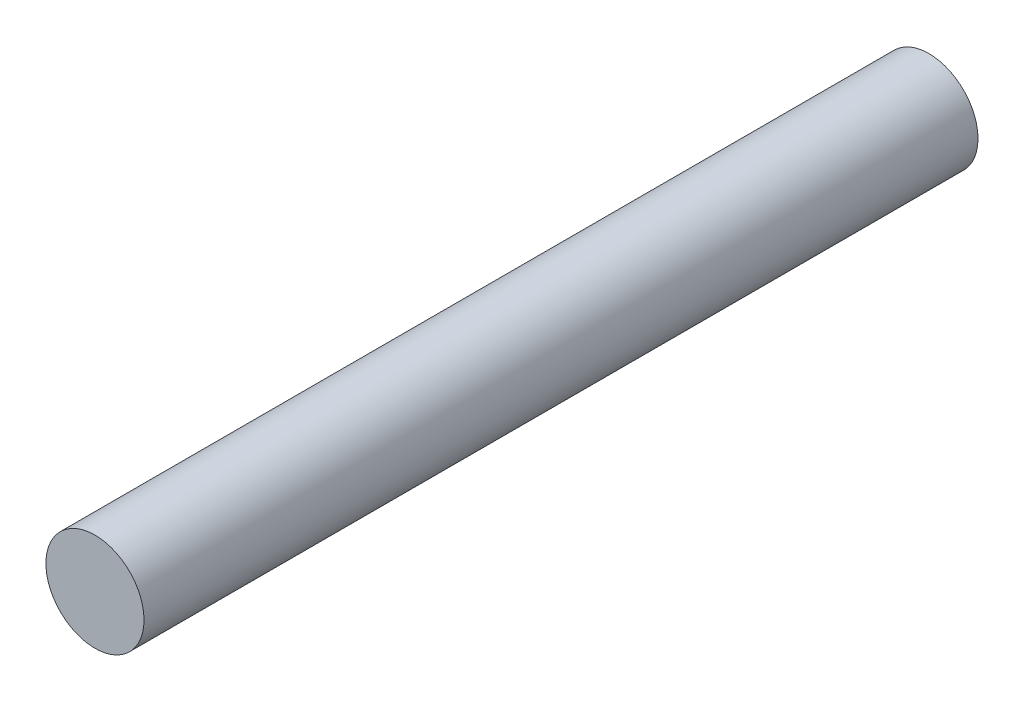
ISO-10303-21;
HEADER;
FILE_DESCRIPTION(('STEP AP214'),'2;1');
FILE_NAME('part.step','',(''),(''),'','','');
FILE_SCHEMA(('AUTOMOTIVE_DESIGN { 1 0 10303 214 1 1 1 1 }'));
ENDSEC;
DATA;
#1=APPLICATION_CONTEXT('core data for automotive mechanical design processes');
#2=APPLICATION_PROTOCOL_DEFINITION('international standard','automotive_design',2000,#1);
#3=PRODUCT_CONTEXT('',#1,'mechanical');
#4=PRODUCT('Part','Part','',(#3));
#5=PRODUCT_RELATED_PRODUCT_CATEGORY('part','',(#4));
#6=PRODUCT_DEFINITION_FORMATION('','',#4);
#7=PRODUCT_DEFINITION_CONTEXT('part definition',#1,'design');
#8=PRODUCT_DEFINITION('design','',#6,#7);
#9=PRODUCT_DEFINITION_SHAPE('','',#8);
#10=(LENGTH_UNIT() NAMED_UNIT(*) SI_UNIT(.MILLI.,.METRE.));
#11=(NAMED_UNIT(*) PLANE_ANGLE_UNIT() SI_UNIT($,.RADIAN.));
#12=(NAMED_UNIT(*) SI_UNIT($,.STERADIAN.) SOLID_ANGLE_UNIT());
#13=UNCERTAINTY_MEASURE_WITH_UNIT(LENGTH_MEASURE(1.E-05),#10,'distance_accuracy_value','');
#14=(GEOMETRIC_REPRESENTATION_CONTEXT(3) GLOBAL_UNCERTAINTY_ASSIGNED_CONTEXT((#13)) GLOBAL_UNIT_ASSIGNED_CONTEXT((#10,
#11,#12)) REPRESENTATION_CONTEXT('',''));
#15=CARTESIAN_POINT('',(0.,0.,0.));
#16=DIRECTION('',(0.,0.,1.));
#17=DIRECTION('',(1.,0.,0.));
#18=AXIS2_PLACEMENT_3D('',#15,#16,#17);
#19=CARTESIAN_POINT('',(0.,0.,85.));
#20=DIRECTION('',(0.,0.,-1.));
#21=DIRECTION('',(-1.,0.,0.));
#22=AXIS2_PLACEMENT_3D('',#19,#20,#21);
#23=CYLINDRICAL_SURFACE('',#22,5.);
#24=CARTESIAN_POINT('',(0.,0.,85.));
#25=DIRECTION('',(0.,0.,1.));
#26=DIRECTION('',(1.,0.,0.));
#27=AXIS2_PLACEMENT_3D('',#24,#25,#26);
#28=CIRCLE('',#27,5.);
#29=CARTESIAN_POINT('',(5.,0.,85.));
#30=VERTEX_POINT('',#29);
#31=EDGE_CURVE('E10',#30,#30,#28,.T.);
#32=ORIENTED_EDGE('',*,*,#31,.F.);
#33=EDGE_LOOP('',(#32));
#34=FACE_BOUND('',#33,.T.);
#35=CARTESIAN_POINT('',(0.,0.,0.));
#36=DIRECTION('',(0.,0.,1.));
#37=DIRECTION('',(1.,0.,0.));
#38=AXIS2_PLACEMENT_3D('',#35,#36,#37);
#39=CIRCLE('',#38,5.);
#40=CARTESIAN_POINT('',(5.,0.,0.));
#41=VERTEX_POINT('',#40);
#42=EDGE_CURVE('E40',#41,#41,#39,.T.);
#43=ORIENTED_EDGE('',*,*,#42,.T.);
#44=EDGE_LOOP('',(#43));
#45=FACE_BOUND('',#44,.T.);
#46=ADVANCED_FACE('F37',(#34,#45),#23,.T.);
#47=CARTESIAN_POINT('',(0.,0.,85.));
#48=DIRECTION('',(0.,0.,1.));
#49=DIRECTION('',(1.,0.,0.));
#50=AXIS2_PLACEMENT_3D('',#47,#48,#49);
#51=PLANE('',#50);
#52=ORIENTED_EDGE('',*,*,#31,.T.);
#53=EDGE_LOOP('',(#52));
#54=FACE_BOUND('',#53,.T.);
#55=ADVANCED_FACE('F54',(#54),#51,.T.);
#56=CARTESIAN_POINT('',(0.,0.,0.));
#57=DIRECTION('',(0.,0.,1.));
#58=DIRECTION('',(1.,0.,0.));
#59=AXIS2_PLACEMENT_3D('',#56,#57,#58);
#60=PLANE('',#59);
#61=ORIENTED_EDGE('',*,*,#42,.F.);
#62=EDGE_LOOP('',(#61));
#63=FACE_BOUND('',#62,.T.);
#64=ADVANCED_FACE('F52',(#63),#60,.F.);
#65=CLOSED_SHELL('',(#46,#55,#64));
#66=MANIFOLD_SOLID_BREP('B2',#65);
#67=ADVANCED_BREP_SHAPE_REPRESENTATION('',(#18,#66),#14);
#68=SHAPE_DEFINITION_REPRESENTATION(#9,#67);
ENDSEC;
END-ISO-10303-21;
